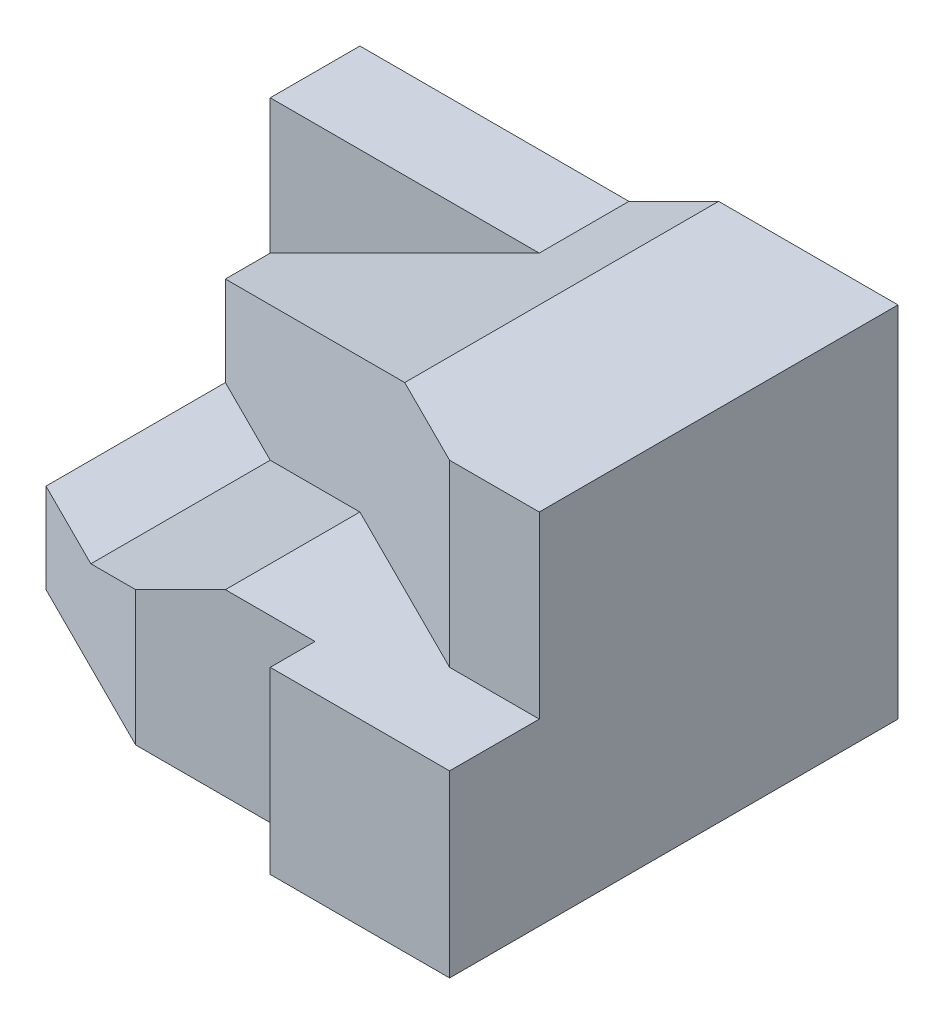
ISO-10303-21;
HEADER;
FILE_DESCRIPTION(('STEP AP214'),'2;1');
FILE_NAME('part.step','',(''),(''),'','','');
FILE_SCHEMA(('AUTOMOTIVE_DESIGN { 1 0 10303 214 1 1 1 1 }'));
ENDSEC;
DATA;
#1=APPLICATION_CONTEXT('core data for automotive mechanical design processes');
#2=APPLICATION_PROTOCOL_DEFINITION('international standard','automotive_design',2000,#1);
#3=PRODUCT_CONTEXT('',#1,'mechanical');
#4=PRODUCT('Part','Part','',(#3));
#5=PRODUCT_RELATED_PRODUCT_CATEGORY('part','',(#4));
#6=PRODUCT_DEFINITION_FORMATION('','',#4);
#7=PRODUCT_DEFINITION_CONTEXT('part definition',#1,'design');
#8=PRODUCT_DEFINITION('design','',#6,#7);
#9=PRODUCT_DEFINITION_SHAPE('','',#8);
#10=(LENGTH_UNIT() NAMED_UNIT(*) SI_UNIT(.MILLI.,.METRE.));
#11=(NAMED_UNIT(*) PLANE_ANGLE_UNIT() SI_UNIT($,.RADIAN.));
#12=(NAMED_UNIT(*) SI_UNIT($,.STERADIAN.) SOLID_ANGLE_UNIT());
#13=UNCERTAINTY_MEASURE_WITH_UNIT(LENGTH_MEASURE(1.E-05),#10,'distance_accuracy_value','');
#14=(GEOMETRIC_REPRESENTATION_CONTEXT(3) GLOBAL_UNCERTAINTY_ASSIGNED_CONTEXT((#13)) GLOBAL_UNIT_ASSIGNED_CONTEXT((#10,
#11,#12)) REPRESENTATION_CONTEXT('',''));
#15=CARTESIAN_POINT('',(0.,0.,0.));
#16=DIRECTION('',(0.,0.,1.));
#17=DIRECTION('',(1.,0.,0.));
#18=AXIS2_PLACEMENT_3D('',#15,#16,#17);
#19=CARTESIAN_POINT('',(0.,20.,0.));
#20=DIRECTION('',(0.,-1.,0.));
#21=DIRECTION('',(0.,0.,-1.));
#22=AXIS2_PLACEMENT_3D('',#19,#20,#21);
#23=PLANE('',#22);
#24=DIRECTION('',(-0.894427190999916,0.,-0.447213595499958));
#25=VECTOR('',#24,1.);
#26=CARTESIAN_POINT('',(0.,20.,-30.));
#27=LINE('',#26,#25);
#28=CARTESIAN_POINT('',(20.,20.,-20.));
#29=VERTEX_POINT('',#28);
#30=CARTESIAN_POINT('',(0.,20.,-30.));
#31=VERTEX_POINT('',#30);
#32=EDGE_CURVE('E144',#29,#31,#27,.T.);
#33=ORIENTED_EDGE('',*,*,#32,.F.);
#34=DIRECTION('',(0.,0.,1.));
#35=VECTOR('',#34,1.);
#36=CARTESIAN_POINT('',(20.,20.,-60.));
#37=LINE('',#36,#35);
#38=CARTESIAN_POINT('',(20.,20.,-60.));
#39=VERTEX_POINT('',#38);
#40=EDGE_CURVE('E152',#39,#29,#37,.T.);
#41=ORIENTED_EDGE('',*,*,#40,.F.);
#42=DIRECTION('',(0.894427190999916,0.,0.447213595499958));
#43=VECTOR('',#42,1.);
#44=CARTESIAN_POINT('',(0.,20.,-70.));
#45=LINE('',#44,#43);
#46=CARTESIAN_POINT('',(0.,20.,-70.));
#47=VERTEX_POINT('',#46);
#48=EDGE_CURVE('E166',#47,#39,#45,.T.);
#49=ORIENTED_EDGE('',*,*,#48,.F.);
#50=DIRECTION('',(0.,0.,1.));
#51=VECTOR('',#50,1.);
#52=CARTESIAN_POINT('',(0.,20.,0.));
#53=LINE('',#52,#51);
#54=EDGE_CURVE('E157',#47,#31,#53,.T.);
#55=ORIENTED_EDGE('',*,*,#54,.T.);
#56=EDGE_LOOP('',(#33,#41,#49,#55));
#57=FACE_BOUND('',#56,.T.);
#58=ADVANCED_FACE('F33',(#57),#23,.F.);
#59=CARTESIAN_POINT('',(60.,40.,-100.));
#60=DIRECTION('',(-0.447213595499958,0.894427190999916,0.));
#61=DIRECTION('',(-0.894427190999916,-0.447213595499958,0.));
#62=AXIS2_PLACEMENT_3D('',#59,#60,#61);
#63=PLANE('',#62);
#64=DIRECTION('',(0.816496580927726,0.408248290463863,0.408248290463863));
#65=VECTOR('',#64,1.);
#66=CARTESIAN_POINT('',(40.,30.,-10.));
#67=LINE('',#66,#65);
#68=CARTESIAN_POINT('',(40.,30.,-10.));
#69=VERTEX_POINT('',#68);
#70=EDGE_CURVE('E141',#29,#69,#67,.T.);
#71=ORIENTED_EDGE('',*,*,#70,.T.);
#72=DIRECTION('',(-0.894427190999916,-0.447213595499958,0.));
#73=VECTOR('',#72,1.);
#74=CARTESIAN_POINT('',(60.,40.,-10.));
#75=LINE('',#74,#73);
#76=CARTESIAN_POINT('',(60.,40.,-10.));
#77=VERTEX_POINT('',#76);
#78=EDGE_CURVE('E221',#77,#69,#75,.T.);
#79=ORIENTED_EDGE('',*,*,#78,.F.);
#80=DIRECTION('',(0.,0.,1.));
#81=VECTOR('',#80,1.);
#82=CARTESIAN_POINT('',(60.,40.,-100.));
#83=LINE('',#82,#81);
#84=CARTESIAN_POINT('',(60.,40.,-40.0000000000001));
#85=VERTEX_POINT('',#84);
#86=EDGE_CURVE('E223',#85,#77,#83,.T.);
#87=ORIENTED_EDGE('',*,*,#86,.F.);
#88=DIRECTION('',(-0.816496580927726,-0.408248290463863,-0.408248290463863));
#89=VECTOR('',#88,1.);
#90=CARTESIAN_POINT('',(40.,30.,-50.0000000000001));
#91=LINE('',#90,#89);
#92=EDGE_CURVE('E164',#85,#39,#91,.T.);
#93=ORIENTED_EDGE('',*,*,#92,.T.);
#94=ORIENTED_EDGE('',*,*,#40,.T.);
#95=EDGE_LOOP('',(#71,#79,#87,#93,#94));
#96=FACE_BOUND('',#95,.T.);
#97=ADVANCED_FACE('F162',(#96),#63,.T.);
#98=CARTESIAN_POINT('',(120.,40.,-100.));
#99=DIRECTION('',(0.,1.,0.));
#100=DIRECTION('',(-1.,0.,0.));
#101=AXIS2_PLACEMENT_3D('',#98,#99,#100);
#102=PLANE('',#101);
#103=DIRECTION('',(0.894427190999916,0.,0.447213595499958));
#104=VECTOR('',#103,1.);
#105=CARTESIAN_POINT('',(84.,40.,-28.));
#106=LINE('',#105,#104);
#107=CARTESIAN_POINT('',(100.,40.,-20.));
#108=VERTEX_POINT('',#107);
#109=EDGE_CURVE('E51',#85,#108,#106,.T.);
#110=ORIENTED_EDGE('',*,*,#109,.F.);
#111=ORIENTED_EDGE('',*,*,#86,.T.);
#112=DIRECTION('',(-1.,0.,0.));
#113=VECTOR('',#112,1.);
#114=CARTESIAN_POINT('',(80.,40.,-10.));
#115=LINE('',#114,#113);
#116=CARTESIAN_POINT('',(80.,40.,-10.));
#117=VERTEX_POINT('',#116);
#118=EDGE_CURVE('E218',#117,#77,#115,.T.);
#119=ORIENTED_EDGE('',*,*,#118,.F.);
#120=DIRECTION('',(0.,0.,1.));
#121=VECTOR('',#120,1.);
#122=CARTESIAN_POINT('',(80.,40.,-100.));
#123=LINE('',#122,#121);
#124=CARTESIAN_POINT('',(80.,40.,0.));
#125=VERTEX_POINT('',#124);
#126=EDGE_CURVE('E160',#117,#125,#123,.T.);
#127=ORIENTED_EDGE('',*,*,#126,.T.);
#128=DIRECTION('',(-1.,0.,0.));
#129=VECTOR('',#128,1.);
#130=CARTESIAN_POINT('',(120.,40.,0.));
#131=LINE('',#130,#129);
#132=CARTESIAN_POINT('',(120.,40.,0.));
#133=VERTEX_POINT('',#132);
#134=EDGE_CURVE('E225',#133,#125,#131,.T.);
#135=ORIENTED_EDGE('',*,*,#134,.F.);
#136=DIRECTION('',(0.,0.,1.));
#137=VECTOR('',#136,1.);
#138=CARTESIAN_POINT('',(120.,40.,-100.));
#139=LINE('',#138,#137);
#140=CARTESIAN_POINT('',(120.,40.,-20.));
#141=VERTEX_POINT('',#140);
#142=EDGE_CURVE('E57',#141,#133,#139,.T.);
#143=ORIENTED_EDGE('',*,*,#142,.F.);
#144=DIRECTION('',(1.,0.,0.));
#145=VECTOR('',#144,1.);
#146=CARTESIAN_POINT('',(120.,40.,-20.));
#147=LINE('',#146,#145);
#148=EDGE_CURVE('E37',#108,#141,#147,.T.);
#149=ORIENTED_EDGE('',*,*,#148,.F.);
#150=EDGE_LOOP('',(#110,#111,#119,#127,#135,#143,#149));
#151=FACE_BOUND('',#150,.T.);
#152=ADVANCED_FACE('F259',(#151),#102,.T.);
#153=CARTESIAN_POINT('',(0.,0.,-80.));
#154=DIRECTION('',(0.,0.,-1.));
#155=DIRECTION('',(-1.,0.,0.));
#156=AXIS2_PLACEMENT_3D('',#153,#154,#155);
#157=PLANE('',#156);
#158=DIRECTION('',(-0.894427190999916,-0.447213595499958,0.));
#159=VECTOR('',#158,1.);
#160=CARTESIAN_POINT('',(-16.,32.,-80.));
#161=LINE('',#160,#159);
#162=CARTESIAN_POINT('',(60.,70.,-80.));
#163=VERTEX_POINT('',#162);
#164=CARTESIAN_POINT('',(0.,40.,-80.));
#165=VERTEX_POINT('',#164);
#166=EDGE_CURVE('E177',#163,#165,#161,.T.);
#167=ORIENTED_EDGE('',*,*,#166,.F.);
#168=DIRECTION('',(1.,0.,0.));
#169=VECTOR('',#168,1.);
#170=CARTESIAN_POINT('',(0.,70.,-80.));
#171=LINE('',#170,#169);
#172=CARTESIAN_POINT('',(0.,70.,-80.));
#173=VERTEX_POINT('',#172);
#174=EDGE_CURVE('E189',#173,#163,#171,.T.);
#175=ORIENTED_EDGE('',*,*,#174,.F.);
#176=DIRECTION('',(0.,1.,0.));
#177=VECTOR('',#176,1.);
#178=CARTESIAN_POINT('',(0.,20.,-80.));
#179=LINE('',#178,#177);
#180=EDGE_CURVE('E187',#165,#173,#179,.T.);
#181=ORIENTED_EDGE('',*,*,#180,.F.);
#182=EDGE_LOOP('',(#167,#175,#181));
#183=FACE_BOUND('',#182,.T.);
#184=ADVANCED_FACE('F261',(#183),#157,.F.);
#185=CARTESIAN_POINT('',(0.,20.,0.));
#186=DIRECTION('',(1.,0.,0.));
#187=DIRECTION('',(0.,0.,-1.));
#188=AXIS2_PLACEMENT_3D('',#185,#186,#187);
#189=PLANE('',#188);
#190=ORIENTED_EDGE('',*,*,#54,.F.);
#191=DIRECTION('',(0.,-1.,0.));
#192=VECTOR('',#191,1.);
#193=CARTESIAN_POINT('',(0.,20.,-70.));
#194=LINE('',#193,#192);
#195=CARTESIAN_POINT('',(0.,40.,-70.0000000000001));
#196=VERTEX_POINT('',#195);
#197=EDGE_CURVE('E180',#196,#47,#194,.T.);
#198=ORIENTED_EDGE('',*,*,#197,.F.);
#199=DIRECTION('',(0.,0.,-1.));
#200=VECTOR('',#199,1.);
#201=CARTESIAN_POINT('',(0.,40.,-70.));
#202=LINE('',#201,#200);
#203=EDGE_CURVE('E183',#196,#165,#202,.T.);
#204=ORIENTED_EDGE('',*,*,#203,.T.);
#205=ORIENTED_EDGE('',*,*,#180,.T.);
#206=DIRECTION('',(0.,0.,-1.));
#207=VECTOR('',#206,1.);
#208=CARTESIAN_POINT('',(0.,70.,-80.));
#209=LINE('',#208,#207);
#210=CARTESIAN_POINT('',(0.,70.,-100.));
#211=VERTEX_POINT('',#210);
#212=EDGE_CURVE('E192',#173,#211,#209,.T.);
#213=ORIENTED_EDGE('',*,*,#212,.T.);
#214=DIRECTION('',(0.,-1.,0.));
#215=VECTOR('',#214,1.);
#216=CARTESIAN_POINT('',(0.,20.,-100.));
#217=LINE('',#216,#215);
#218=CARTESIAN_POINT('',(0.,0.,-100.));
#219=VERTEX_POINT('',#218);
#220=EDGE_CURVE('E315',#211,#219,#217,.T.);
#221=ORIENTED_EDGE('',*,*,#220,.T.);
#222=DIRECTION('',(0.,0.,1.));
#223=VECTOR('',#222,1.);
#224=CARTESIAN_POINT('',(0.,0.,0.));
#225=LINE('',#224,#223);
#226=CARTESIAN_POINT('',(0.,0.,-30.));
#227=VERTEX_POINT('',#226);
#228=EDGE_CURVE('E317',#219,#227,#225,.T.);
#229=ORIENTED_EDGE('',*,*,#228,.T.);
#230=DIRECTION('',(0.,1.,0.));
#231=VECTOR('',#230,1.);
#232=CARTESIAN_POINT('',(0.,0.,-30.));
#233=LINE('',#232,#231);
#234=EDGE_CURVE('E320',#227,#31,#233,.T.);
#235=ORIENTED_EDGE('',*,*,#234,.T.);
#236=EDGE_LOOP('',(#190,#198,#204,#205,#213,#221,#229,#235));
#237=FACE_BOUND('',#236,.T.);
#238=ADVANCED_FACE('F35',(#237),#189,.F.);
#239=CARTESIAN_POINT('',(0.,20.,0.));
#240=DIRECTION('',(0.,0.,-1.));
#241=DIRECTION('',(-1.,0.,0.));
#242=AXIS2_PLACEMENT_3D('',#239,#240,#241);
#243=PLANE('',#242);
#244=DIRECTION('',(0.,-1.,0.));
#245=VECTOR('',#244,1.);
#246=CARTESIAN_POINT('',(120.,20.,0.));
#247=LINE('',#246,#245);
#248=CARTESIAN_POINT('',(120.,0.,0.));
#249=VERTEX_POINT('',#248);
#250=EDGE_CURVE('E11',#133,#249,#247,.T.);
#251=ORIENTED_EDGE('',*,*,#250,.F.);
#252=ORIENTED_EDGE('',*,*,#134,.T.);
#253=DIRECTION('',(0.,1.,0.));
#254=VECTOR('',#253,1.);
#255=CARTESIAN_POINT('',(80.,0.,0.));
#256=LINE('',#255,#254);
#257=CARTESIAN_POINT('',(80.,0.,0.));
#258=VERTEX_POINT('',#257);
#259=EDGE_CURVE('E303',#258,#125,#256,.T.);
#260=ORIENTED_EDGE('',*,*,#259,.F.);
#261=DIRECTION('',(1.,0.,0.));
#262=VECTOR('',#261,1.);
#263=CARTESIAN_POINT('',(0.,0.,0.));
#264=LINE('',#263,#262);
#265=EDGE_CURVE('E296',#258,#249,#264,.T.);
#266=ORIENTED_EDGE('',*,*,#265,.T.);
#267=EDGE_LOOP('',(#251,#252,#260,#266));
#268=FACE_BOUND('',#267,.T.);
#269=ADVANCED_FACE('F288',(#268),#243,.F.);
#270=CARTESIAN_POINT('',(120.,20.,0.));
#271=DIRECTION('',(-1.,0.,0.));
#272=DIRECTION('',(0.,0.,1.));
#273=AXIS2_PLACEMENT_3D('',#270,#271,#272);
#274=PLANE('',#273);
#275=DIRECTION('',(0.,0.,-1.));
#276=VECTOR('',#275,1.);
#277=CARTESIAN_POINT('',(120.,0.,0.));
#278=LINE('',#277,#276);
#279=CARTESIAN_POINT('',(120.,0.,-100.));
#280=VERTEX_POINT('',#279);
#281=EDGE_CURVE('E322',#249,#280,#278,.T.);
#282=ORIENTED_EDGE('',*,*,#281,.T.);
#283=DIRECTION('',(0.,-1.,0.));
#284=VECTOR('',#283,1.);
#285=CARTESIAN_POINT('',(120.,20.,-100.));
#286=LINE('',#285,#284);
#287=CARTESIAN_POINT('',(120.,80.,-100.));
#288=VERTEX_POINT('',#287);
#289=EDGE_CURVE('E43',#288,#280,#286,.T.);
#290=ORIENTED_EDGE('',*,*,#289,.F.);
#291=DIRECTION('',(0.,0.,1.));
#292=VECTOR('',#291,1.);
#293=CARTESIAN_POINT('',(120.,80.,-100.));
#294=LINE('',#293,#292);
#295=CARTESIAN_POINT('',(120.,80.,-20.));
#296=VERTEX_POINT('',#295);
#297=EDGE_CURVE('E209',#288,#296,#294,.T.);
#298=ORIENTED_EDGE('',*,*,#297,.T.);
#299=DIRECTION('',(0.,1.,0.));
#300=VECTOR('',#299,1.);
#301=CARTESIAN_POINT('',(120.,40.,-20.));
#302=LINE('',#301,#300);
#303=EDGE_CURVE('E205',#141,#296,#302,.T.);
#304=ORIENTED_EDGE('',*,*,#303,.F.);
#305=ORIENTED_EDGE('',*,*,#142,.T.);
#306=ORIENTED_EDGE('',*,*,#250,.T.);
#307=EDGE_LOOP('',(#282,#290,#298,#304,#305,#306));
#308=FACE_BOUND('',#307,.T.);
#309=ADVANCED_FACE('F242',(#308),#274,.F.);
#310=CARTESIAN_POINT('',(0.,20.,-100.));
#311=DIRECTION('',(0.,0.,1.));
#312=DIRECTION('',(1.,0.,0.));
#313=AXIS2_PLACEMENT_3D('',#310,#311,#312);
#314=PLANE('',#313);
#315=DIRECTION('',(0.894427190999916,0.447213595499958,0.));
#316=VECTOR('',#315,1.);
#317=CARTESIAN_POINT('',(60.,70.,-100.));
#318=LINE('',#317,#316);
#319=CARTESIAN_POINT('',(60.,70.,-100.));
#320=VERTEX_POINT('',#319);
#321=CARTESIAN_POINT('',(80.,80.,-100.));
#322=VERTEX_POINT('',#321);
#323=EDGE_CURVE('E171',#320,#322,#318,.T.);
#324=ORIENTED_EDGE('',*,*,#323,.T.);
#325=DIRECTION('',(-1.,0.,0.));
#326=VECTOR('',#325,1.);
#327=CARTESIAN_POINT('',(120.,80.,-100.));
#328=LINE('',#327,#326);
#329=EDGE_CURVE('E206',#288,#322,#328,.T.);
#330=ORIENTED_EDGE('',*,*,#329,.F.);
#331=ORIENTED_EDGE('',*,*,#289,.T.);
#332=DIRECTION('',(-1.,0.,0.));
#333=VECTOR('',#332,1.);
#334=CARTESIAN_POINT('',(0.,0.,-100.));
#335=LINE('',#334,#333);
#336=EDGE_CURVE('E316',#280,#219,#335,.T.);
#337=ORIENTED_EDGE('',*,*,#336,.T.);
#338=ORIENTED_EDGE('',*,*,#220,.F.);
#339=DIRECTION('',(1.,0.,0.));
#340=VECTOR('',#339,1.);
#341=CARTESIAN_POINT('',(0.,70.,-100.));
#342=LINE('',#341,#340);
#343=EDGE_CURVE('E186',#211,#320,#342,.T.);
#344=ORIENTED_EDGE('',*,*,#343,.T.);
#345=EDGE_LOOP('',(#324,#330,#331,#337,#338,#344));
#346=FACE_BOUND('',#345,.T.);
#347=ADVANCED_FACE('F282',(#346),#314,.F.);
#348=CARTESIAN_POINT('',(0.,0.,0.));
#349=DIRECTION('',(0.,-1.,0.));
#350=DIRECTION('',(0.,0.,-1.));
#351=AXIS2_PLACEMENT_3D('',#348,#349,#350);
#352=PLANE('',#351);
#353=ORIENTED_EDGE('',*,*,#228,.F.);
#354=ORIENTED_EDGE('',*,*,#336,.F.);
#355=ORIENTED_EDGE('',*,*,#281,.F.);
#356=ORIENTED_EDGE('',*,*,#265,.F.);
#357=DIRECTION('',(0.,0.,-1.));
#358=VECTOR('',#357,1.);
#359=CARTESIAN_POINT('',(80.,0.,-10.));
#360=LINE('',#359,#358);
#361=CARTESIAN_POINT('',(80.,0.,-10.));
#362=VERTEX_POINT('',#361);
#363=EDGE_CURVE('E159',#258,#362,#360,.T.);
#364=ORIENTED_EDGE('',*,*,#363,.T.);
#365=DIRECTION('',(-1.,0.,0.));
#366=VECTOR('',#365,1.);
#367=CARTESIAN_POINT('',(40.,0.,-10.));
#368=LINE('',#367,#366);
#369=CARTESIAN_POINT('',(40.,0.,-10.));
#370=VERTEX_POINT('',#369);
#371=EDGE_CURVE('E310',#362,#370,#368,.T.);
#372=ORIENTED_EDGE('',*,*,#371,.T.);
#373=DIRECTION('',(-0.894427190999916,0.,-0.447213595499958));
#374=VECTOR('',#373,1.);
#375=CARTESIAN_POINT('',(0.,0.,-30.));
#376=LINE('',#375,#374);
#377=EDGE_CURVE('E306',#370,#227,#376,.T.);
#378=ORIENTED_EDGE('',*,*,#377,.T.);
#379=EDGE_LOOP('',(#353,#354,#355,#356,#364,#372,#378));
#380=FACE_BOUND('',#379,.T.);
#381=ADVANCED_FACE('F279',(#380),#352,.T.);
#382=CARTESIAN_POINT('',(0.,0.,-30.));
#383=DIRECTION('',(0.447213595499958,0.,-0.894427190999916));
#384=DIRECTION('',(-0.894427190999916,0.,-0.447213595499958));
#385=AXIS2_PLACEMENT_3D('',#382,#383,#384);
#386=PLANE('',#385);
#387=DIRECTION('',(0.,1.,0.));
#388=VECTOR('',#387,1.);
#389=CARTESIAN_POINT('',(40.,0.,-10.));
#390=LINE('',#389,#388);
#391=EDGE_CURVE('E147',#370,#69,#390,.T.);
#392=ORIENTED_EDGE('',*,*,#391,.T.);
#393=ORIENTED_EDGE('',*,*,#70,.F.);
#394=ORIENTED_EDGE('',*,*,#32,.T.);
#395=ORIENTED_EDGE('',*,*,#234,.F.);
#396=ORIENTED_EDGE('',*,*,#377,.F.);
#397=EDGE_LOOP('',(#392,#393,#394,#395,#396));
#398=FACE_BOUND('',#397,.T.);
#399=ADVANCED_FACE('F143',(#398),#386,.F.);
#400=CARTESIAN_POINT('',(40.,0.,-10.));
#401=DIRECTION('',(0.,0.,-1.));
#402=DIRECTION('',(-1.,0.,0.));
#403=AXIS2_PLACEMENT_3D('',#400,#401,#402);
#404=PLANE('',#403);
#405=ORIENTED_EDGE('',*,*,#78,.T.);
#406=ORIENTED_EDGE('',*,*,#391,.F.);
#407=ORIENTED_EDGE('',*,*,#371,.F.);
#408=DIRECTION('',(0.,1.,0.));
#409=VECTOR('',#408,1.);
#410=CARTESIAN_POINT('',(80.,0.,-10.));
#411=LINE('',#410,#409);
#412=EDGE_CURVE('E305',#362,#117,#411,.T.);
#413=ORIENTED_EDGE('',*,*,#412,.T.);
#414=ORIENTED_EDGE('',*,*,#118,.T.);
#415=EDGE_LOOP('',(#405,#406,#407,#413,#414));
#416=FACE_BOUND('',#415,.T.);
#417=ADVANCED_FACE('F349',(#416),#404,.F.);
#418=CARTESIAN_POINT('',(80.,0.,-10.));
#419=DIRECTION('',(1.,0.,0.));
#420=DIRECTION('',(0.,0.,-1.));
#421=AXIS2_PLACEMENT_3D('',#418,#419,#420);
#422=PLANE('',#421);
#423=ORIENTED_EDGE('',*,*,#126,.F.);
#424=ORIENTED_EDGE('',*,*,#412,.F.);
#425=ORIENTED_EDGE('',*,*,#363,.F.);
#426=ORIENTED_EDGE('',*,*,#259,.T.);
#427=EDGE_LOOP('',(#423,#424,#425,#426));
#428=FACE_BOUND('',#427,.T.);
#429=ADVANCED_FACE('F277',(#428),#422,.F.);
#430=CARTESIAN_POINT('',(120.,80.,-100.));
#431=DIRECTION('',(0.,1.,0.));
#432=DIRECTION('',(0.,0.,1.));
#433=AXIS2_PLACEMENT_3D('',#430,#431,#432);
#434=PLANE('',#433);
#435=DIRECTION('',(-1.,0.,0.));
#436=VECTOR('',#435,1.);
#437=CARTESIAN_POINT('',(120.,80.,-20.));
#438=LINE('',#437,#436);
#439=CARTESIAN_POINT('',(100.,80.,-20.));
#440=VERTEX_POINT('',#439);
#441=EDGE_CURVE('E210',#296,#440,#438,.T.);
#442=ORIENTED_EDGE('',*,*,#441,.F.);
#443=ORIENTED_EDGE('',*,*,#297,.F.);
#444=ORIENTED_EDGE('',*,*,#329,.T.);
#445=DIRECTION('',(0.,0.,1.));
#446=VECTOR('',#445,1.);
#447=CARTESIAN_POINT('',(80.,80.,-100.));
#448=LINE('',#447,#446);
#449=CARTESIAN_POINT('',(80.,80.,-30.));
#450=VERTEX_POINT('',#449);
#451=EDGE_CURVE('E197',#322,#450,#448,.T.);
#452=ORIENTED_EDGE('',*,*,#451,.T.);
#453=DIRECTION('',(0.894427190999916,0.,0.447213595499958));
#454=VECTOR('',#453,1.);
#455=CARTESIAN_POINT('',(80.,80.,-30.));
#456=LINE('',#455,#454);
#457=EDGE_CURVE('E201',#450,#440,#456,.T.);
#458=ORIENTED_EDGE('',*,*,#457,.T.);
#459=EDGE_LOOP('',(#442,#443,#444,#452,#458));
#460=FACE_BOUND('',#459,.T.);
#461=ADVANCED_FACE('F248',(#460),#434,.T.);
#462=CARTESIAN_POINT('',(0.,0.,-20.));
#463=DIRECTION('',(0.,0.,1.));
#464=DIRECTION('',(1.,0.,0.));
#465=AXIS2_PLACEMENT_3D('',#462,#463,#464);
#466=PLANE('',#465);
#467=ORIENTED_EDGE('',*,*,#303,.T.);
#468=ORIENTED_EDGE('',*,*,#441,.T.);
#469=DIRECTION('',(0.,-1.,0.));
#470=VECTOR('',#469,1.);
#471=CARTESIAN_POINT('',(100.,40.,-20.));
#472=LINE('',#471,#470);
#473=EDGE_CURVE('E213',#440,#108,#472,.T.);
#474=ORIENTED_EDGE('',*,*,#473,.T.);
#475=ORIENTED_EDGE('',*,*,#148,.T.);
#476=EDGE_LOOP('',(#467,#468,#474,#475));
#477=FACE_BOUND('',#476,.T.);
#478=ADVANCED_FACE('F239',(#477),#466,.T.);
#479=CARTESIAN_POINT('',(80.,0.,-30.));
#480=DIRECTION('',(-0.447213595499958,0.,0.894427190999916));
#481=DIRECTION('',(0.894427190999916,0.,0.447213595499958));
#482=AXIS2_PLACEMENT_3D('',#479,#480,#481);
#483=PLANE('',#482);
#484=ORIENTED_EDGE('',*,*,#48,.T.);
#485=ORIENTED_EDGE('',*,*,#92,.F.);
#486=ORIENTED_EDGE('',*,*,#109,.T.);
#487=ORIENTED_EDGE('',*,*,#473,.F.);
#488=ORIENTED_EDGE('',*,*,#457,.F.);
#489=DIRECTION('',(-0.816496580927726,-0.408248290463863,-0.408248290463863));
#490=VECTOR('',#489,1.);
#491=CARTESIAN_POINT('',(80.,80.,-30.));
#492=LINE('',#491,#490);
#493=EDGE_CURVE('E174',#450,#196,#492,.T.);
#494=ORIENTED_EDGE('',*,*,#493,.T.);
#495=ORIENTED_EDGE('',*,*,#197,.T.);
#496=EDGE_LOOP('',(#484,#485,#486,#487,#488,#494,#495));
#497=FACE_BOUND('',#496,.T.);
#498=ADVANCED_FACE('F252',(#497),#483,.T.);
#499=CARTESIAN_POINT('',(0.,70.,-80.));
#500=DIRECTION('',(0.,1.,0.));
#501=DIRECTION('',(-1.,0.,0.));
#502=AXIS2_PLACEMENT_3D('',#499,#500,#501);
#503=PLANE('',#502);
#504=ORIENTED_EDGE('',*,*,#343,.F.);
#505=ORIENTED_EDGE('',*,*,#212,.F.);
#506=ORIENTED_EDGE('',*,*,#174,.T.);
#507=DIRECTION('',(0.,0.,-1.));
#508=VECTOR('',#507,1.);
#509=CARTESIAN_POINT('',(60.,70.,-80.));
#510=LINE('',#509,#508);
#511=EDGE_CURVE('E195',#163,#320,#510,.T.);
#512=ORIENTED_EDGE('',*,*,#511,.T.);
#513=EDGE_LOOP('',(#504,#505,#506,#512));
#514=FACE_BOUND('',#513,.T.);
#515=ADVANCED_FACE('F332',(#514),#503,.T.);
#516=CARTESIAN_POINT('',(-16.,32.,0.));
#517=DIRECTION('',(0.447213595499958,-0.894427190999916,0.));
#518=DIRECTION('',(0.894427190999916,0.447213595499958,0.));
#519=AXIS2_PLACEMENT_3D('',#516,#517,#518);
#520=PLANE('',#519);
#521=ORIENTED_EDGE('',*,*,#511,.F.);
#522=ORIENTED_EDGE('',*,*,#166,.T.);
#523=ORIENTED_EDGE('',*,*,#203,.F.);
#524=ORIENTED_EDGE('',*,*,#493,.F.);
#525=ORIENTED_EDGE('',*,*,#451,.F.);
#526=ORIENTED_EDGE('',*,*,#323,.F.);
#527=EDGE_LOOP('',(#521,#522,#523,#524,#525,#526));
#528=FACE_BOUND('',#527,.T.);
#529=ADVANCED_FACE('F255',(#528),#520,.F.);
#530=CLOSED_SHELL('',(#58,#97,#152,#184,#238,#269,#309,#347,#381,#399,#417,#429,#461,#478,#498,
#515,#529));
#531=MANIFOLD_SOLID_BREP('B2',#530);
#532=ADVANCED_BREP_SHAPE_REPRESENTATION('',(#18,#531),#14);
#533=SHAPE_DEFINITION_REPRESENTATION(#9,#532);
ENDSEC;
END-ISO-10303-21;
